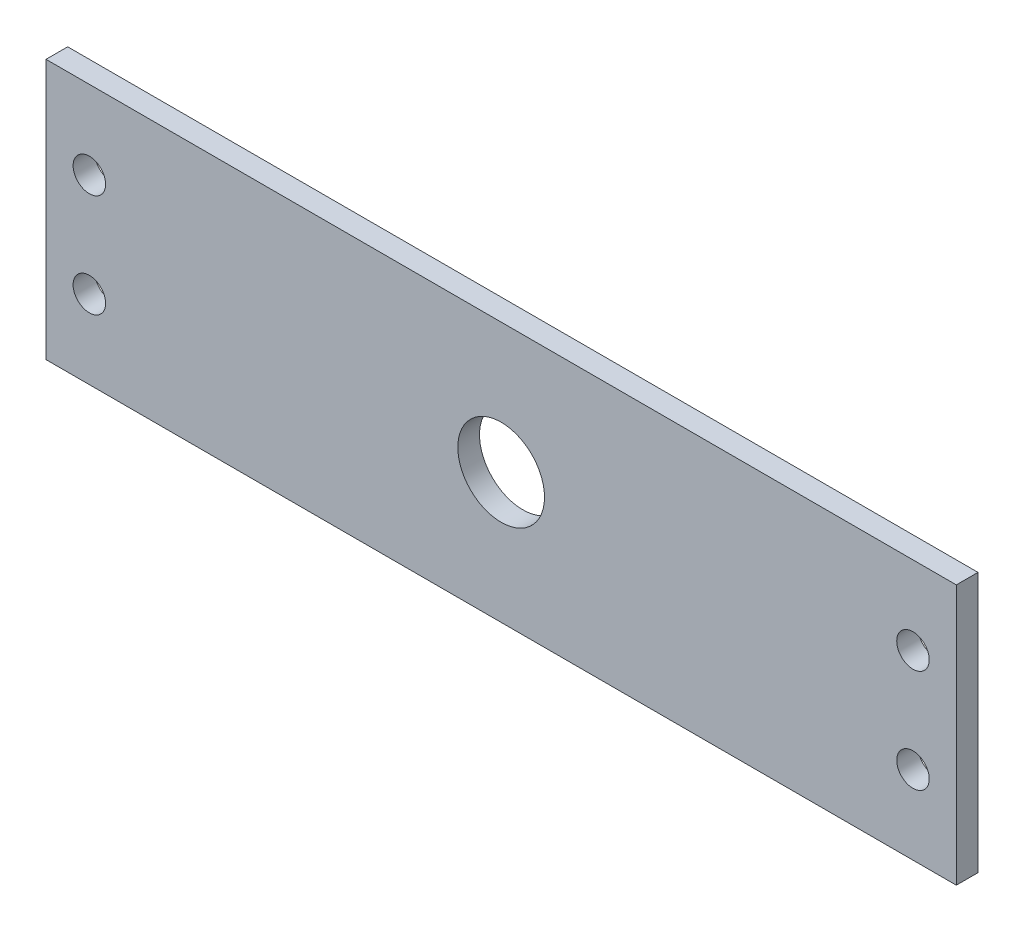
ISO-10303-21;
HEADER;
FILE_DESCRIPTION(('STEP AP214'),'2;1');
FILE_NAME('part.step','',(''),(''),'','','');
FILE_SCHEMA(('AUTOMOTIVE_DESIGN { 1 0 10303 214 1 1 1 1 }'));
ENDSEC;
DATA;
#1=APPLICATION_CONTEXT('core data for automotive mechanical design processes');
#2=APPLICATION_PROTOCOL_DEFINITION('international standard','automotive_design',2000,#1);
#3=PRODUCT_CONTEXT('',#1,'mechanical');
#4=PRODUCT('Part','Part','',(#3));
#5=PRODUCT_RELATED_PRODUCT_CATEGORY('part','',(#4));
#6=PRODUCT_DEFINITION_FORMATION('','',#4);
#7=PRODUCT_DEFINITION_CONTEXT('part definition',#1,'design');
#8=PRODUCT_DEFINITION('design','',#6,#7);
#9=PRODUCT_DEFINITION_SHAPE('','',#8);
#10=(LENGTH_UNIT() NAMED_UNIT(*) SI_UNIT(.MILLI.,.METRE.));
#11=(NAMED_UNIT(*) PLANE_ANGLE_UNIT() SI_UNIT($,.RADIAN.));
#12=(NAMED_UNIT(*) SI_UNIT($,.STERADIAN.) SOLID_ANGLE_UNIT());
#13=UNCERTAINTY_MEASURE_WITH_UNIT(LENGTH_MEASURE(1.E-05),#10,'distance_accuracy_value','');
#14=(GEOMETRIC_REPRESENTATION_CONTEXT(3) GLOBAL_UNCERTAINTY_ASSIGNED_CONTEXT((#13)) GLOBAL_UNIT_ASSIGNED_CONTEXT((#10,
#11,#12)) REPRESENTATION_CONTEXT('',''));
#15=CARTESIAN_POINT('',(0.,0.,0.));
#16=DIRECTION('',(0.,0.,1.));
#17=DIRECTION('',(1.,0.,0.));
#18=AXIS2_PLACEMENT_3D('',#15,#16,#17);
#19=CARTESIAN_POINT('',(0.,0.,12.7));
#20=DIRECTION('',(1.,0.,0.));
#21=DIRECTION('',(0.,0.,-1.));
#22=AXIS2_PLACEMENT_3D('',#19,#20,#21);
#23=PLANE('',#22);
#24=DIRECTION('',(0.,-1.,0.));
#25=VECTOR('',#24,1.);
#26=CARTESIAN_POINT('',(0.,0.,0.));
#27=LINE('',#26,#25);
#28=CARTESIAN_POINT('',(0.,152.4,0.));
#29=VERTEX_POINT('',#28);
#30=CARTESIAN_POINT('',(0.,0.,0.));
#31=VERTEX_POINT('',#30);
#32=EDGE_CURVE('E80',#29,#31,#27,.T.);
#33=ORIENTED_EDGE('',*,*,#32,.T.);
#34=DIRECTION('',(0.,0.,-1.));
#35=VECTOR('',#34,1.);
#36=CARTESIAN_POINT('',(0.,0.,12.7));
#37=LINE('',#36,#35);
#38=CARTESIAN_POINT('',(0.,0.,12.7));
#39=VERTEX_POINT('',#38);
#40=EDGE_CURVE('E11',#39,#31,#37,.T.);
#41=ORIENTED_EDGE('',*,*,#40,.F.);
#42=DIRECTION('',(0.,-1.,0.));
#43=VECTOR('',#42,1.);
#44=CARTESIAN_POINT('',(0.,0.,12.7));
#45=LINE('',#44,#43);
#46=CARTESIAN_POINT('',(0.,152.4,12.7));
#47=VERTEX_POINT('',#46);
#48=EDGE_CURVE('E68',#47,#39,#45,.T.);
#49=ORIENTED_EDGE('',*,*,#48,.F.);
#50=DIRECTION('',(0.,0.,-1.));
#51=VECTOR('',#50,1.);
#52=CARTESIAN_POINT('',(0.,152.4,12.7));
#53=LINE('',#52,#51);
#54=EDGE_CURVE('E76',#47,#29,#53,.T.);
#55=ORIENTED_EDGE('',*,*,#54,.T.);
#56=EDGE_LOOP('',(#33,#41,#49,#55));
#57=FACE_BOUND('',#56,.T.);
#58=ADVANCED_FACE('F17',(#57),#23,.F.);
#59=CARTESIAN_POINT('',(0.,0.,12.7));
#60=DIRECTION('',(0.,1.,0.));
#61=DIRECTION('',(0.,0.,1.));
#62=AXIS2_PLACEMENT_3D('',#59,#60,#61);
#63=PLANE('',#62);
#64=DIRECTION('',(1.,0.,0.));
#65=VECTOR('',#64,1.);
#66=CARTESIAN_POINT('',(0.,0.,0.));
#67=LINE('',#66,#65);
#68=CARTESIAN_POINT('',(533.4,0.,0.));
#69=VERTEX_POINT('',#68);
#70=EDGE_CURVE('E72',#31,#69,#67,.T.);
#71=ORIENTED_EDGE('',*,*,#70,.T.);
#72=DIRECTION('',(0.,0.,-1.));
#73=VECTOR('',#72,1.);
#74=CARTESIAN_POINT('',(533.4,0.,12.7));
#75=LINE('',#74,#73);
#76=CARTESIAN_POINT('',(533.4,0.,12.7));
#77=VERTEX_POINT('',#76);
#78=EDGE_CURVE('E25',#77,#69,#75,.T.);
#79=ORIENTED_EDGE('',*,*,#78,.F.);
#80=DIRECTION('',(1.,0.,0.));
#81=VECTOR('',#80,1.);
#82=CARTESIAN_POINT('',(0.,0.,12.7));
#83=LINE('',#82,#81);
#84=EDGE_CURVE('E63',#39,#77,#83,.T.);
#85=ORIENTED_EDGE('',*,*,#84,.F.);
#86=ORIENTED_EDGE('',*,*,#40,.T.);
#87=EDGE_LOOP('',(#71,#79,#85,#86));
#88=FACE_BOUND('',#87,.T.);
#89=ADVANCED_FACE('F71',(#88),#63,.F.);
#90=CARTESIAN_POINT('',(533.4,0.,12.7));
#91=DIRECTION('',(-1.,0.,0.));
#92=DIRECTION('',(0.,0.,1.));
#93=AXIS2_PLACEMENT_3D('',#90,#91,#92);
#94=PLANE('',#93);
#95=DIRECTION('',(0.,1.,0.));
#96=VECTOR('',#95,1.);
#97=CARTESIAN_POINT('',(533.4,0.,0.));
#98=LINE('',#97,#96);
#99=CARTESIAN_POINT('',(533.4,152.4,0.));
#100=VERTEX_POINT('',#99);
#101=EDGE_CURVE('E50',#69,#100,#98,.T.);
#102=ORIENTED_EDGE('',*,*,#101,.T.);
#103=DIRECTION('',(0.,0.,-1.));
#104=VECTOR('',#103,1.);
#105=CARTESIAN_POINT('',(533.4,152.4,12.7));
#106=LINE('',#105,#104);
#107=CARTESIAN_POINT('',(533.4,152.4,12.7));
#108=VERTEX_POINT('',#107);
#109=EDGE_CURVE('E73',#108,#100,#106,.T.);
#110=ORIENTED_EDGE('',*,*,#109,.F.);
#111=DIRECTION('',(0.,1.,0.));
#112=VECTOR('',#111,1.);
#113=CARTESIAN_POINT('',(533.4,0.,12.7));
#114=LINE('',#113,#112);
#115=EDGE_CURVE('E66',#77,#108,#114,.T.);
#116=ORIENTED_EDGE('',*,*,#115,.F.);
#117=ORIENTED_EDGE('',*,*,#78,.T.);
#118=EDGE_LOOP('',(#102,#110,#116,#117));
#119=FACE_BOUND('',#118,.T.);
#120=ADVANCED_FACE('F74',(#119),#94,.F.);
#121=CARTESIAN_POINT('',(0.,152.4,12.7));
#122=DIRECTION('',(0.,-1.,0.));
#123=DIRECTION('',(0.,0.,-1.));
#124=AXIS2_PLACEMENT_3D('',#121,#122,#123);
#125=PLANE('',#124);
#126=DIRECTION('',(-1.,0.,0.));
#127=VECTOR('',#126,1.);
#128=CARTESIAN_POINT('',(0.,152.4,0.));
#129=LINE('',#128,#127);
#130=EDGE_CURVE('E56',#100,#29,#129,.T.);
#131=ORIENTED_EDGE('',*,*,#130,.T.);
#132=ORIENTED_EDGE('',*,*,#54,.F.);
#133=DIRECTION('',(-1.,0.,0.));
#134=VECTOR('',#133,1.);
#135=CARTESIAN_POINT('',(0.,152.4,12.7));
#136=LINE('',#135,#134);
#137=EDGE_CURVE('E33',#108,#47,#136,.T.);
#138=ORIENTED_EDGE('',*,*,#137,.F.);
#139=ORIENTED_EDGE('',*,*,#109,.T.);
#140=EDGE_LOOP('',(#131,#132,#138,#139));
#141=FACE_BOUND('',#140,.T.);
#142=ADVANCED_FACE('F88',(#141),#125,.F.);
#143=CARTESIAN_POINT('',(0.,0.,12.7));
#144=DIRECTION('',(0.,0.,-1.));
#145=DIRECTION('',(-1.,0.,0.));
#146=AXIS2_PLACEMENT_3D('',#143,#144,#145);
#147=PLANE('',#146);
#148=CARTESIAN_POINT('',(266.7,76.2,12.7));
#149=DIRECTION('',(0.,0.,1.));
#150=DIRECTION('',(1.,0.,0.));
#151=AXIS2_PLACEMENT_3D('',#148,#149,#150);
#152=CIRCLE('',#151,25.4);
#153=CARTESIAN_POINT('',(292.1,76.2,12.7));
#154=VERTEX_POINT('',#153);
#155=EDGE_CURVE('E118',#154,#154,#152,.T.);
#156=ORIENTED_EDGE('',*,*,#155,.F.);
#157=EDGE_LOOP('',(#156));
#158=FACE_BOUND('',#157,.T.);
#159=CARTESIAN_POINT('',(25.4,106.426,12.7));
#160=DIRECTION('',(0.,0.,1.));
#161=DIRECTION('',(1.,0.,0.));
#162=AXIS2_PLACEMENT_3D('',#159,#160,#161);
#163=CIRCLE('',#162,9.525);
#164=CARTESIAN_POINT('',(34.925,106.426,12.7));
#165=VERTEX_POINT('',#164);
#166=EDGE_CURVE('E112',#165,#165,#163,.T.);
#167=ORIENTED_EDGE('',*,*,#166,.F.);
#168=EDGE_LOOP('',(#167));
#169=FACE_BOUND('',#168,.T.);
#170=CARTESIAN_POINT('',(25.4,45.974,12.7));
#171=DIRECTION('',(0.,0.,1.));
#172=DIRECTION('',(-1.,0.,0.));
#173=AXIS2_PLACEMENT_3D('',#170,#171,#172);
#174=CIRCLE('',#173,9.525);
#175=CARTESIAN_POINT('',(15.875,45.974,12.7));
#176=VERTEX_POINT('',#175);
#177=EDGE_CURVE('E106',#176,#176,#174,.T.);
#178=ORIENTED_EDGE('',*,*,#177,.F.);
#179=EDGE_LOOP('',(#178));
#180=FACE_BOUND('',#179,.T.);
#181=CARTESIAN_POINT('',(508.,106.426,12.7));
#182=DIRECTION('',(0.,0.,1.));
#183=DIRECTION('',(-1.,0.,0.));
#184=AXIS2_PLACEMENT_3D('',#181,#182,#183);
#185=CIRCLE('',#184,9.525);
#186=CARTESIAN_POINT('',(498.475,106.426,12.7));
#187=VERTEX_POINT('',#186);
#188=EDGE_CURVE('E100',#187,#187,#185,.T.);
#189=ORIENTED_EDGE('',*,*,#188,.F.);
#190=EDGE_LOOP('',(#189));
#191=FACE_BOUND('',#190,.T.);
#192=CARTESIAN_POINT('',(508.,45.974,12.7));
#193=DIRECTION('',(0.,0.,1.));
#194=DIRECTION('',(1.,0.,0.));
#195=AXIS2_PLACEMENT_3D('',#192,#193,#194);
#196=CIRCLE('',#195,9.525);
#197=CARTESIAN_POINT('',(517.525,45.974,12.7));
#198=VERTEX_POINT('',#197);
#199=EDGE_CURVE('E94',#198,#198,#196,.T.);
#200=ORIENTED_EDGE('',*,*,#199,.F.);
#201=EDGE_LOOP('',(#200));
#202=FACE_BOUND('',#201,.T.);
#203=ORIENTED_EDGE('',*,*,#48,.T.);
#204=ORIENTED_EDGE('',*,*,#84,.T.);
#205=ORIENTED_EDGE('',*,*,#115,.T.);
#206=ORIENTED_EDGE('',*,*,#137,.T.);
#207=EDGE_LOOP('',(#203,#204,#205,#206));
#208=FACE_BOUND('',#207,.T.);
#209=ADVANCED_FACE('F64',(#158,#169,#180,#191,#202,#208),#147,.F.);
#210=CARTESIAN_POINT('',(0.,0.,0.));
#211=DIRECTION('',(0.,0.,-1.));
#212=DIRECTION('',(-1.,0.,0.));
#213=AXIS2_PLACEMENT_3D('',#210,#211,#212);
#214=PLANE('',#213);
#215=CARTESIAN_POINT('',(266.7,76.2,0.));
#216=DIRECTION('',(0.,0.,1.));
#217=DIRECTION('',(1.,0.,0.));
#218=AXIS2_PLACEMENT_3D('',#215,#216,#217);
#219=CIRCLE('',#218,25.4);
#220=CARTESIAN_POINT('',(292.1,76.2,0.));
#221=VERTEX_POINT('',#220);
#222=EDGE_CURVE('E115',#221,#221,#219,.T.);
#223=ORIENTED_EDGE('',*,*,#222,.T.);
#224=EDGE_LOOP('',(#223));
#225=FACE_BOUND('',#224,.T.);
#226=CARTESIAN_POINT('',(25.4,106.426,0.));
#227=DIRECTION('',(0.,0.,1.));
#228=DIRECTION('',(1.,0.,0.));
#229=AXIS2_PLACEMENT_3D('',#226,#227,#228);
#230=CIRCLE('',#229,9.525);
#231=CARTESIAN_POINT('',(34.925,106.426,0.));
#232=VERTEX_POINT('',#231);
#233=EDGE_CURVE('E109',#232,#232,#230,.T.);
#234=ORIENTED_EDGE('',*,*,#233,.T.);
#235=EDGE_LOOP('',(#234));
#236=FACE_BOUND('',#235,.T.);
#237=CARTESIAN_POINT('',(25.4,45.974,0.));
#238=DIRECTION('',(0.,0.,1.));
#239=DIRECTION('',(-1.,0.,0.));
#240=AXIS2_PLACEMENT_3D('',#237,#238,#239);
#241=CIRCLE('',#240,9.525);
#242=CARTESIAN_POINT('',(15.875,45.974,0.));
#243=VERTEX_POINT('',#242);
#244=EDGE_CURVE('E103',#243,#243,#241,.T.);
#245=ORIENTED_EDGE('',*,*,#244,.T.);
#246=EDGE_LOOP('',(#245));
#247=FACE_BOUND('',#246,.T.);
#248=CARTESIAN_POINT('',(508.,106.426,0.));
#249=DIRECTION('',(0.,0.,1.));
#250=DIRECTION('',(-1.,0.,0.));
#251=AXIS2_PLACEMENT_3D('',#248,#249,#250);
#252=CIRCLE('',#251,9.525);
#253=CARTESIAN_POINT('',(498.475,106.426,0.));
#254=VERTEX_POINT('',#253);
#255=EDGE_CURVE('E97',#254,#254,#252,.T.);
#256=ORIENTED_EDGE('',*,*,#255,.T.);
#257=EDGE_LOOP('',(#256));
#258=FACE_BOUND('',#257,.T.);
#259=CARTESIAN_POINT('',(508.,45.974,0.));
#260=DIRECTION('',(0.,0.,1.));
#261=DIRECTION('',(1.,0.,0.));
#262=AXIS2_PLACEMENT_3D('',#259,#260,#261);
#263=CIRCLE('',#262,9.525);
#264=CARTESIAN_POINT('',(517.525,45.974,0.));
#265=VERTEX_POINT('',#264);
#266=EDGE_CURVE('E83',#265,#265,#263,.T.);
#267=ORIENTED_EDGE('',*,*,#266,.T.);
#268=EDGE_LOOP('',(#267));
#269=FACE_BOUND('',#268,.T.);
#270=ORIENTED_EDGE('',*,*,#32,.F.);
#271=ORIENTED_EDGE('',*,*,#130,.F.);
#272=ORIENTED_EDGE('',*,*,#101,.F.);
#273=ORIENTED_EDGE('',*,*,#70,.F.);
#274=EDGE_LOOP('',(#270,#271,#272,#273));
#275=FACE_BOUND('',#274,.T.);
#276=ADVANCED_FACE('F91',(#225,#236,#247,#258,#269,#275),#214,.T.);
#277=CARTESIAN_POINT('',(508.,45.974,0.));
#278=DIRECTION('',(0.,0.,1.));
#279=DIRECTION('',(1.,0.,0.));
#280=AXIS2_PLACEMENT_3D('',#277,#278,#279);
#281=CYLINDRICAL_SURFACE('',#280,9.525);
#282=ORIENTED_EDGE('',*,*,#266,.F.);
#283=EDGE_LOOP('',(#282));
#284=FACE_BOUND('',#283,.T.);
#285=ORIENTED_EDGE('',*,*,#199,.T.);
#286=EDGE_LOOP('',(#285));
#287=FACE_BOUND('',#286,.T.);
#288=ADVANCED_FACE('F144',(#284,#287),#281,.F.);
#289=CARTESIAN_POINT('',(508.,106.426,0.));
#290=DIRECTION('',(0.,0.,1.));
#291=DIRECTION('',(1.,0.,0.));
#292=AXIS2_PLACEMENT_3D('',#289,#290,#291);
#293=CYLINDRICAL_SURFACE('',#292,9.525);
#294=ORIENTED_EDGE('',*,*,#255,.F.);
#295=EDGE_LOOP('',(#294));
#296=FACE_BOUND('',#295,.T.);
#297=ORIENTED_EDGE('',*,*,#188,.T.);
#298=EDGE_LOOP('',(#297));
#299=FACE_BOUND('',#298,.T.);
#300=ADVANCED_FACE('F146',(#296,#299),#293,.F.);
#301=CARTESIAN_POINT('',(25.4,45.974,0.));
#302=DIRECTION('',(0.,0.,1.));
#303=DIRECTION('',(1.,0.,0.));
#304=AXIS2_PLACEMENT_3D('',#301,#302,#303);
#305=CYLINDRICAL_SURFACE('',#304,9.525);
#306=ORIENTED_EDGE('',*,*,#244,.F.);
#307=EDGE_LOOP('',(#306));
#308=FACE_BOUND('',#307,.T.);
#309=ORIENTED_EDGE('',*,*,#177,.T.);
#310=EDGE_LOOP('',(#309));
#311=FACE_BOUND('',#310,.T.);
#312=ADVANCED_FACE('F155',(#308,#311),#305,.F.);
#313=CARTESIAN_POINT('',(25.4,106.426,0.));
#314=DIRECTION('',(0.,0.,1.));
#315=DIRECTION('',(1.,0.,0.));
#316=AXIS2_PLACEMENT_3D('',#313,#314,#315);
#317=CYLINDRICAL_SURFACE('',#316,9.525);
#318=ORIENTED_EDGE('',*,*,#233,.F.);
#319=EDGE_LOOP('',(#318));
#320=FACE_BOUND('',#319,.T.);
#321=ORIENTED_EDGE('',*,*,#166,.T.);
#322=EDGE_LOOP('',(#321));
#323=FACE_BOUND('',#322,.T.);
#324=ADVANCED_FACE('F129',(#320,#323),#317,.F.);
#325=CARTESIAN_POINT('',(266.7,76.2,0.));
#326=DIRECTION('',(0.,0.,1.));
#327=DIRECTION('',(1.,0.,0.));
#328=AXIS2_PLACEMENT_3D('',#325,#326,#327);
#329=CYLINDRICAL_SURFACE('',#328,25.4);
#330=ORIENTED_EDGE('',*,*,#222,.F.);
#331=EDGE_LOOP('',(#330));
#332=FACE_BOUND('',#331,.T.);
#333=ORIENTED_EDGE('',*,*,#155,.T.);
#334=EDGE_LOOP('',(#333));
#335=FACE_BOUND('',#334,.T.);
#336=ADVANCED_FACE('F126',(#332,#335),#329,.F.);
#337=CLOSED_SHELL('',(#58,#89,#120,#142,#209,#276,#288,#300,#312,#324,#336));
#338=MANIFOLD_SOLID_BREP('B1',#337);
#339=ADVANCED_BREP_SHAPE_REPRESENTATION('',(#18,#338),#14);
#340=SHAPE_DEFINITION_REPRESENTATION(#9,#339);
ENDSEC;
END-ISO-10303-21;
